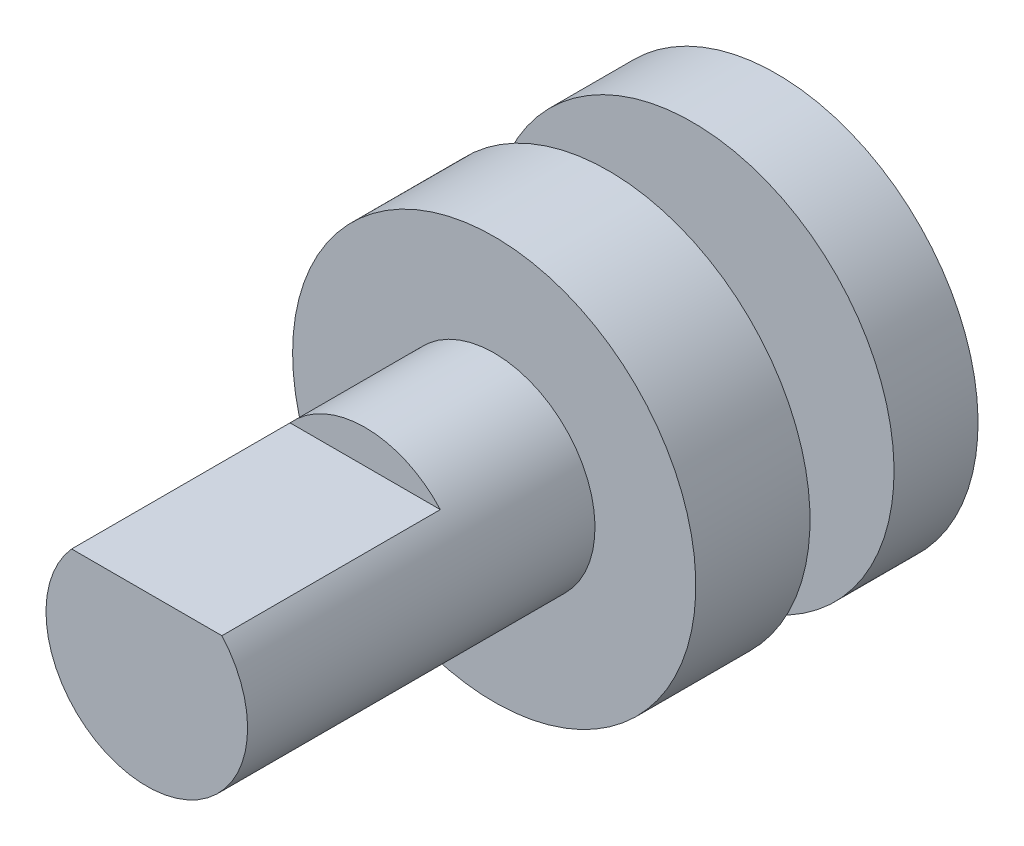
ISO-10303-21;
HEADER;
FILE_DESCRIPTION(('STEP AP214'),'2;1');
FILE_NAME('part.step','',(''),(''),'','','');
FILE_SCHEMA(('AUTOMOTIVE_DESIGN { 1 0 10303 214 1 1 1 1 }'));
ENDSEC;
DATA;
#1=APPLICATION_CONTEXT('core data for automotive mechanical design processes');
#2=APPLICATION_PROTOCOL_DEFINITION('international standard','automotive_design',2000,#1);
#3=PRODUCT_CONTEXT('',#1,'mechanical');
#4=PRODUCT('Part','Part','',(#3));
#5=PRODUCT_RELATED_PRODUCT_CATEGORY('part','',(#4));
#6=PRODUCT_DEFINITION_FORMATION('','',#4);
#7=PRODUCT_DEFINITION_CONTEXT('part definition',#1,'design');
#8=PRODUCT_DEFINITION('design','',#6,#7);
#9=PRODUCT_DEFINITION_SHAPE('','',#8);
#10=(LENGTH_UNIT() NAMED_UNIT(*) SI_UNIT(.MILLI.,.METRE.));
#11=(NAMED_UNIT(*) PLANE_ANGLE_UNIT() SI_UNIT($,.RADIAN.));
#12=(NAMED_UNIT(*) SI_UNIT($,.STERADIAN.) SOLID_ANGLE_UNIT());
#13=UNCERTAINTY_MEASURE_WITH_UNIT(LENGTH_MEASURE(1.E-05),#10,'distance_accuracy_value','');
#14=(GEOMETRIC_REPRESENTATION_CONTEXT(3) GLOBAL_UNCERTAINTY_ASSIGNED_CONTEXT((#13)) GLOBAL_UNIT_ASSIGNED_CONTEXT((#10,
#11,#12)) REPRESENTATION_CONTEXT('',''));
#15=CARTESIAN_POINT('',(0.,0.,0.));
#16=DIRECTION('',(0.,0.,1.));
#17=DIRECTION('',(1.,0.,0.));
#18=AXIS2_PLACEMENT_3D('',#15,#16,#17);
#19=CARTESIAN_POINT('',(-1.518,-1.515,6.87));
#20=DIRECTION('',(0.,0.,1.));
#21=DIRECTION('',(1.,0.,0.));
#22=AXIS2_PLACEMENT_3D('',#19,#20,#21);
#23=PLANE('',#22);
#24=CARTESIAN_POINT('',(0.,0.,6.87));
#25=DIRECTION('',(0.,0.,-1.));
#26=DIRECTION('',(0.,1.,0.));
#27=AXIS2_PLACEMENT_3D('',#24,#25,#26);
#28=CIRCLE('',#27,1.5);
#29=CARTESIAN_POINT('',(-1.11803398886338,0.999999999873122,6.87));
#30=VERTEX_POINT('',#29);
#31=CARTESIAN_POINT('',(1.11803398856848,1.00000000020283,6.87));
#32=VERTEX_POINT('',#31);
#33=EDGE_CURVE('E21',#30,#32,#28,.F.);
#34=ORIENTED_EDGE('',*,*,#33,.T.);
#35=DIRECTION('',(-1.,0.,0.));
#36=VECTOR('',#35,1.);
#37=CARTESIAN_POINT('',(0.,1.,6.87));
#38=LINE('',#37,#36);
#39=EDGE_CURVE('E47',#32,#30,#38,.T.);
#40=ORIENTED_EDGE('',*,*,#39,.T.);
#41=EDGE_LOOP('',(#34,#40));
#42=FACE_BOUND('',#41,.T.);
#43=ADVANCED_FACE('F17',(#42),#23,.T.);
#44=CARTESIAN_POINT('',(-1.131450397,1.,3.62));
#45=DIRECTION('',(0.,0.,1.));
#46=DIRECTION('',(1.,0.,0.));
#47=AXIS2_PLACEMENT_3D('',#44,#45,#46);
#48=PLANE('',#47);
#49=CARTESIAN_POINT('',(0.,0.,3.62000000236));
#50=DIRECTION('',(0.,0.,-1.));
#51=DIRECTION('',(0.,1.,0.));
#52=AXIS2_PLACEMENT_3D('',#49,#50,#51);
#53=CIRCLE('',#52,1.5);
#54=CARTESIAN_POINT('',(1.11803398856848,1.00000000010141,3.62000000118));
#55=VERTEX_POINT('',#54);
#56=CARTESIAN_POINT('',(-1.11803398886338,0.999999999936561,3.62000000118));
#57=VERTEX_POINT('',#56);
#58=EDGE_CURVE('E41',#55,#57,#53,.F.);
#59=ORIENTED_EDGE('',*,*,#58,.T.);
#60=DIRECTION('',(1.,0.,0.));
#61=VECTOR('',#60,1.);
#62=CARTESIAN_POINT('',(0.,1.,3.62));
#63=LINE('',#62,#61);
#64=EDGE_CURVE('E54',#57,#55,#63,.T.);
#65=ORIENTED_EDGE('',*,*,#64,.T.);
#66=EDGE_LOOP('',(#59,#65));
#67=FACE_BOUND('',#66,.T.);
#68=ADVANCED_FACE('F97',(#67),#48,.T.);
#69=CARTESIAN_POINT('',(-1.118033989,1.,6.87));
#70=DIRECTION('',(0.,-1.,0.));
#71=DIRECTION('',(0.,0.,-1.));
#72=AXIS2_PLACEMENT_3D('',#69,#70,#71);
#73=PLANE('',#72);
#74=DIRECTION('',(0.,0.,1.));
#75=VECTOR('',#74,1.);
#76=CARTESIAN_POINT('',(1.11803398838707,1.00000000040565,4.285));
#77=LINE('',#76,#75);
#78=EDGE_CURVE('E49',#32,#55,#77,.F.);
#79=ORIENTED_EDGE('',*,*,#78,.T.);
#80=ORIENTED_EDGE('',*,*,#64,.F.);
#81=DIRECTION('',(0.,0.,-1.));
#82=VECTOR('',#81,1.);
#83=CARTESIAN_POINT('',(-1.11803398897686,0.999999999746244,4.285));
#84=LINE('',#83,#82);
#85=EDGE_CURVE('E53',#57,#30,#84,.F.);
#86=ORIENTED_EDGE('',*,*,#85,.T.);
#87=ORIENTED_EDGE('',*,*,#39,.F.);
#88=EDGE_LOOP('',(#79,#80,#86,#87));
#89=FACE_BOUND('',#88,.T.);
#90=ADVANCED_FACE('F52',(#89),#73,.F.);
#91=CARTESIAN_POINT('',(0.,0.,6.87));
#92=DIRECTION('',(0.,0.,-1.));
#93=DIRECTION('',(0.,1.,0.));
#94=AXIS2_PLACEMENT_3D('',#91,#92,#93);
#95=CYLINDRICAL_SURFACE('',#94,1.5);
#96=CARTESIAN_POINT('',(0.,0.,1.7));
#97=DIRECTION('',(0.,0.,-1.));
#98=DIRECTION('',(0.,1.,0.));
#99=AXIS2_PLACEMENT_3D('',#96,#97,#98);
#100=CIRCLE('',#99,1.5);
#101=CARTESIAN_POINT('',(0.,1.5,1.7));
#102=VERTEX_POINT('',#101);
#103=EDGE_CURVE('E60',#102,#102,#100,.T.);
#104=ORIENTED_EDGE('',*,*,#103,.F.);
#105=EDGE_LOOP('',(#104));
#106=FACE_BOUND('',#105,.T.);
#107=ORIENTED_EDGE('',*,*,#78,.F.);
#108=ORIENTED_EDGE('',*,*,#33,.F.);
#109=ORIENTED_EDGE('',*,*,#85,.F.);
#110=ORIENTED_EDGE('',*,*,#58,.F.);
#111=EDGE_LOOP('',(#107,#108,#109,#110));
#112=FACE_BOUND('',#111,.T.);
#113=ADVANCED_FACE('F56',(#106,#112),#95,.T.);
#114=CARTESIAN_POINT('',(-3.036,-3.036,1.7));
#115=DIRECTION('',(0.,0.,1.));
#116=DIRECTION('',(1.,0.,0.));
#117=AXIS2_PLACEMENT_3D('',#114,#115,#116);
#118=PLANE('',#117);
#119=ORIENTED_EDGE('',*,*,#103,.T.);
#120=EDGE_LOOP('',(#119));
#121=FACE_BOUND('',#120,.T.);
#122=CARTESIAN_POINT('',(0.,0.,1.7));
#123=DIRECTION('',(0.,0.,-1.));
#124=DIRECTION('',(-1.,0.,0.));
#125=AXIS2_PLACEMENT_3D('',#122,#123,#124);
#126=CIRCLE('',#125,3.);
#127=CARTESIAN_POINT('',(-3.,0.,1.7));
#128=VERTEX_POINT('',#127);
#129=EDGE_CURVE('E79',#128,#128,#126,.F.);
#130=ORIENTED_EDGE('',*,*,#129,.T.);
#131=EDGE_LOOP('',(#130));
#132=FACE_BOUND('',#131,.T.);
#133=ADVANCED_FACE('F85',(#121,#132),#118,.T.);
#134=CARTESIAN_POINT('',(0.,0.,1.7));
#135=DIRECTION('',(0.,0.,-1.));
#136=DIRECTION('',(-1.,0.,0.));
#137=AXIS2_PLACEMENT_3D('',#134,#135,#136);
#138=CYLINDRICAL_SURFACE('',#137,3.);
#139=ORIENTED_EDGE('',*,*,#129,.F.);
#140=EDGE_LOOP('',(#139));
#141=FACE_BOUND('',#140,.T.);
#142=CARTESIAN_POINT('',(0.,0.,0.));
#143=DIRECTION('',(0.,0.,-1.));
#144=DIRECTION('',(-1.,0.,0.));
#145=AXIS2_PLACEMENT_3D('',#142,#143,#144);
#146=CIRCLE('',#145,3.);
#147=CARTESIAN_POINT('',(-3.,0.,0.));
#148=VERTEX_POINT('',#147);
#149=EDGE_CURVE('E76',#148,#148,#146,.F.);
#150=ORIENTED_EDGE('',*,*,#149,.T.);
#151=EDGE_LOOP('',(#150));
#152=FACE_BOUND('',#151,.T.);
#153=ADVANCED_FACE('F95',(#141,#152),#138,.T.);
#154=CARTESIAN_POINT('',(-3.036,-3.036,0.));
#155=DIRECTION('',(0.,0.,1.));
#156=DIRECTION('',(1.,0.,0.));
#157=AXIS2_PLACEMENT_3D('',#154,#155,#156);
#158=PLANE('',#157);
#159=CARTESIAN_POINT('',(0.,0.,0.));
#160=DIRECTION('',(0.,0.,1.));
#161=DIRECTION('',(0.,-1.,0.));
#162=AXIS2_PLACEMENT_3D('',#159,#160,#161);
#163=CIRCLE('',#162,1.);
#164=CARTESIAN_POINT('',(0.,-1.,0.));
#165=VERTEX_POINT('',#164);
#166=EDGE_CURVE('E73',#165,#165,#163,.T.);
#167=ORIENTED_EDGE('',*,*,#166,.T.);
#168=EDGE_LOOP('',(#167));
#169=FACE_BOUND('',#168,.T.);
#170=ORIENTED_EDGE('',*,*,#149,.F.);
#171=EDGE_LOOP('',(#170));
#172=FACE_BOUND('',#171,.T.);
#173=ADVANCED_FACE('F120',(#169,#172),#158,.F.);
#174=CARTESIAN_POINT('',(0.,0.,-1.25));
#175=DIRECTION('',(0.,0.,1.));
#176=DIRECTION('',(0.,-1.,0.));
#177=AXIS2_PLACEMENT_3D('',#174,#175,#176);
#178=CYLINDRICAL_SURFACE('',#177,1.);
#179=CARTESIAN_POINT('',(0.,0.,-1.25));
#180=DIRECTION('',(0.,0.,1.));
#181=DIRECTION('',(0.,-1.,0.));
#182=AXIS2_PLACEMENT_3D('',#179,#180,#181);
#183=CIRCLE('',#182,1.);
#184=CARTESIAN_POINT('',(0.,-1.,-1.25));
#185=VERTEX_POINT('',#184);
#186=EDGE_CURVE('E70',#185,#185,#183,.T.);
#187=ORIENTED_EDGE('',*,*,#186,.T.);
#188=EDGE_LOOP('',(#187));
#189=FACE_BOUND('',#188,.T.);
#190=ORIENTED_EDGE('',*,*,#166,.F.);
#191=EDGE_LOOP('',(#190));
#192=FACE_BOUND('',#191,.T.);
#193=ADVANCED_FACE('F118',(#189,#192),#178,.T.);
#194=CARTESIAN_POINT('',(3.036,-3.036,-1.25));
#195=DIRECTION('',(0.,0.,-1.));
#196=DIRECTION('',(-1.,0.,0.));
#197=AXIS2_PLACEMENT_3D('',#194,#195,#196);
#198=PLANE('',#197);
#199=ORIENTED_EDGE('',*,*,#186,.F.);
#200=EDGE_LOOP('',(#199));
#201=FACE_BOUND('',#200,.T.);
#202=CARTESIAN_POINT('',(0.,0.,-1.25));
#203=DIRECTION('',(0.,0.,1.));
#204=DIRECTION('',(0.,-1.,0.));
#205=AXIS2_PLACEMENT_3D('',#202,#203,#204);
#206=CIRCLE('',#205,3.);
#207=CARTESIAN_POINT('',(0.,-3.,-1.25));
#208=VERTEX_POINT('',#207);
#209=EDGE_CURVE('E67',#208,#208,#206,.T.);
#210=ORIENTED_EDGE('',*,*,#209,.T.);
#211=EDGE_LOOP('',(#210));
#212=FACE_BOUND('',#211,.T.);
#213=ADVANCED_FACE('F116',(#201,#212),#198,.F.);
#214=CARTESIAN_POINT('',(0.,0.,-2.5));
#215=DIRECTION('',(0.,0.,1.));
#216=DIRECTION('',(0.,-1.,0.));
#217=AXIS2_PLACEMENT_3D('',#214,#215,#216);
#218=CYLINDRICAL_SURFACE('',#217,3.);
#219=ORIENTED_EDGE('',*,*,#209,.F.);
#220=EDGE_LOOP('',(#219));
#221=FACE_BOUND('',#220,.T.);
#222=CARTESIAN_POINT('',(0.,0.,-2.5));
#223=DIRECTION('',(0.,0.,1.));
#224=DIRECTION('',(0.,-1.,0.));
#225=AXIS2_PLACEMENT_3D('',#222,#223,#224);
#226=CIRCLE('',#225,3.);
#227=CARTESIAN_POINT('',(0.,-3.,-2.5));
#228=VERTEX_POINT('',#227);
#229=EDGE_CURVE('E64',#228,#228,#226,.F.);
#230=ORIENTED_EDGE('',*,*,#229,.F.);
#231=EDGE_LOOP('',(#230));
#232=FACE_BOUND('',#231,.T.);
#233=ADVANCED_FACE('F113',(#221,#232),#218,.T.);
#234=CARTESIAN_POINT('',(3.036,-3.036,-2.5));
#235=DIRECTION('',(0.,0.,-1.));
#236=DIRECTION('',(-1.,0.,0.));
#237=AXIS2_PLACEMENT_3D('',#234,#235,#236);
#238=PLANE('',#237);
#239=CARTESIAN_POINT('',(0.,0.,-2.5));
#240=DIRECTION('',(0.,0.,1.));
#241=DIRECTION('',(1.,0.,0.));
#242=AXIS2_PLACEMENT_3D('',#239,#240,#241);
#243=CIRCLE('',#242,0.3175);
#244=CARTESIAN_POINT('',(0.3175,0.,-2.5));
#245=VERTEX_POINT('',#244);
#246=EDGE_CURVE('E26',#245,#245,#243,.T.);
#247=ORIENTED_EDGE('',*,*,#246,.T.);
#248=EDGE_LOOP('',(#247));
#249=FACE_BOUND('',#248,.T.);
#250=ORIENTED_EDGE('',*,*,#229,.T.);
#251=EDGE_LOOP('',(#250));
#252=FACE_BOUND('',#251,.T.);
#253=ADVANCED_FACE('F108',(#249,#252),#238,.T.);
#254=CARTESIAN_POINT('',(0.32131,-0.32131,-3.26));
#255=DIRECTION('',(0.,0.,-1.));
#256=DIRECTION('',(-1.,0.,0.));
#257=AXIS2_PLACEMENT_3D('',#254,#255,#256);
#258=PLANE('',#257);
#259=CARTESIAN_POINT('',(0.,0.,-3.26));
#260=DIRECTION('',(0.,0.,1.));
#261=DIRECTION('',(1.,0.,0.));
#262=AXIS2_PLACEMENT_3D('',#259,#260,#261);
#263=CIRCLE('',#262,0.3175);
#264=CARTESIAN_POINT('',(0.3175,0.,-3.26));
#265=VERTEX_POINT('',#264);
#266=EDGE_CURVE('E11',#265,#265,#263,.F.);
#267=ORIENTED_EDGE('',*,*,#266,.T.);
#268=EDGE_LOOP('',(#267));
#269=FACE_BOUND('',#268,.T.);
#270=ADVANCED_FACE('F19',(#269),#258,.T.);
#271=CARTESIAN_POINT('',(0.,0.,-3.26));
#272=DIRECTION('',(0.,0.,1.));
#273=DIRECTION('',(1.,0.,0.));
#274=AXIS2_PLACEMENT_3D('',#271,#272,#273);
#275=CYLINDRICAL_SURFACE('',#274,0.3175);
#276=ORIENTED_EDGE('',*,*,#246,.F.);
#277=EDGE_LOOP('',(#276));
#278=FACE_BOUND('',#277,.T.);
#279=ORIENTED_EDGE('',*,*,#266,.F.);
#280=EDGE_LOOP('',(#279));
#281=FACE_BOUND('',#280,.T.);
#282=ADVANCED_FACE('F101',(#278,#281),#275,.T.);
#283=CLOSED_SHELL('',(#43,#68,#90,#113,#133,#153,#173,#193,#213,#233,#253,#270,#282));
#284=MANIFOLD_SOLID_BREP('B1',#283);
#285=ADVANCED_BREP_SHAPE_REPRESENTATION('',(#18,#284),#14);
#286=SHAPE_DEFINITION_REPRESENTATION(#9,#285);
ENDSEC;
END-ISO-10303-21;
